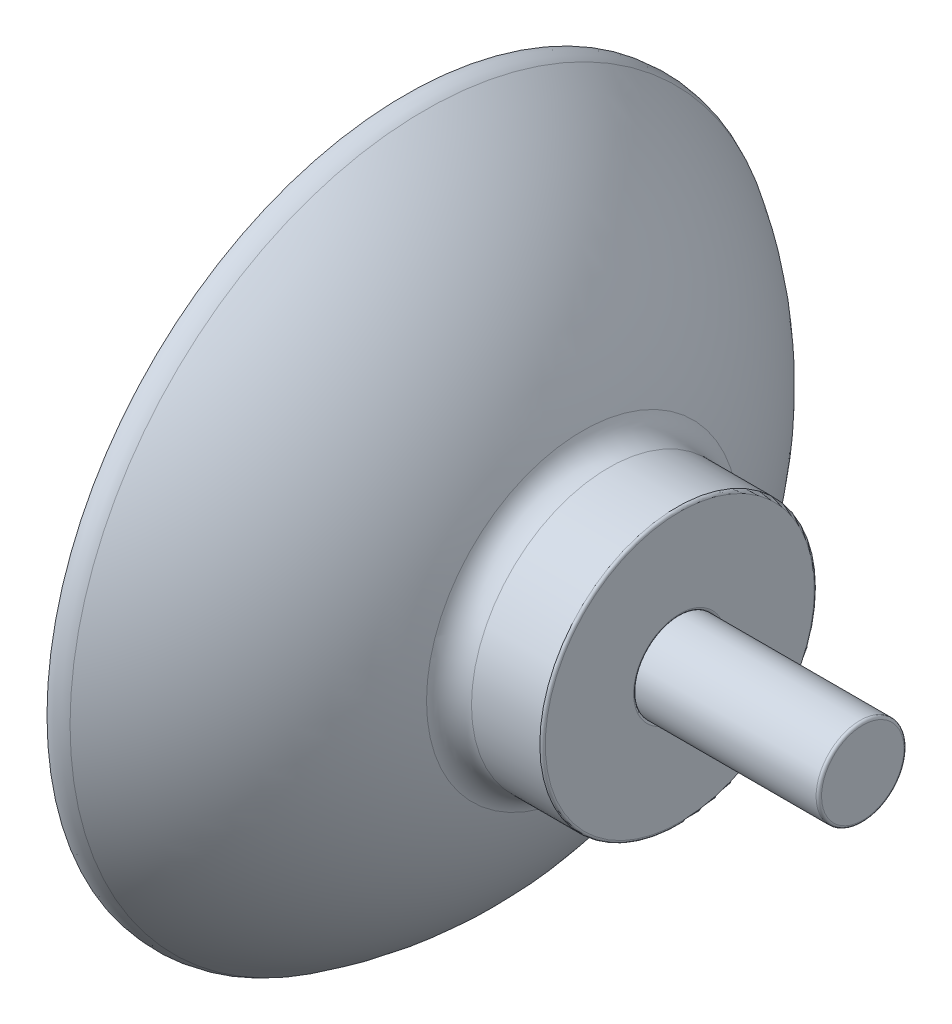
ISO-10303-21;
HEADER;
FILE_DESCRIPTION(('STEP AP214'),'2;1');
FILE_NAME('part.step','',(''),(''),'','','');
FILE_SCHEMA(('AUTOMOTIVE_DESIGN { 1 0 10303 214 1 1 1 1 }'));
ENDSEC;
DATA;
#1=APPLICATION_CONTEXT('core data for automotive mechanical design processes');
#2=APPLICATION_PROTOCOL_DEFINITION('international standard','automotive_design',2000,#1);
#3=PRODUCT_CONTEXT('',#1,'mechanical');
#4=PRODUCT('Part','Part','',(#3));
#5=PRODUCT_RELATED_PRODUCT_CATEGORY('part','',(#4));
#6=PRODUCT_DEFINITION_FORMATION('','',#4);
#7=PRODUCT_DEFINITION_CONTEXT('part definition',#1,'design');
#8=PRODUCT_DEFINITION('design','',#6,#7);
#9=PRODUCT_DEFINITION_SHAPE('','',#8);
#10=(LENGTH_UNIT() NAMED_UNIT(*) SI_UNIT(.MILLI.,.METRE.));
#11=(NAMED_UNIT(*) PLANE_ANGLE_UNIT() SI_UNIT($,.RADIAN.));
#12=(NAMED_UNIT(*) SI_UNIT($,.STERADIAN.) SOLID_ANGLE_UNIT());
#13=UNCERTAINTY_MEASURE_WITH_UNIT(LENGTH_MEASURE(1.E-05),#10,'distance_accuracy_value','');
#14=(GEOMETRIC_REPRESENTATION_CONTEXT(3) GLOBAL_UNCERTAINTY_ASSIGNED_CONTEXT((#13)) GLOBAL_UNIT_ASSIGNED_CONTEXT((#10,
#11,#12)) REPRESENTATION_CONTEXT('',''));
#15=CARTESIAN_POINT('',(0.,0.,0.));
#16=DIRECTION('',(0.,0.,1.));
#17=DIRECTION('',(1.,0.,0.));
#18=AXIS2_PLACEMENT_3D('',#15,#16,#17);
#19=CARTESIAN_POINT('',(2.,0.,0.));
#20=DIRECTION('',(-1.,0.,0.));
#21=DIRECTION('',(0.,-1.,0.));
#22=AXIS2_PLACEMENT_3D('',#19,#20,#21);
#23=PLANE('',#22);
#24=CARTESIAN_POINT('',(2.,0.,0.));
#25=DIRECTION('',(1.,0.,0.));
#26=DIRECTION('',(0.,1.,0.));
#27=AXIS2_PLACEMENT_3D('',#24,#25,#26);
#28=CIRCLE('',#27,4.75);
#29=CARTESIAN_POINT('',(2.,4.75,0.));
#30=VERTEX_POINT('',#29);
#31=EDGE_CURVE('E54',#30,#30,#28,.T.);
#32=ORIENTED_EDGE('',*,*,#31,.F.);
#33=EDGE_LOOP('',(#32));
#34=FACE_BOUND('',#33,.T.);
#35=ADVANCED_FACE('F43',(#34),#23,.T.);
#36=CARTESIAN_POINT('',(15.,0.,0.));
#37=DIRECTION('',(1.,0.,0.));
#38=DIRECTION('',(0.,1.,0.));
#39=AXIS2_PLACEMENT_3D('',#36,#37,#38);
#40=CYLINDRICAL_SURFACE('',#39,4.75);
#41=ORIENTED_EDGE('',*,*,#31,.T.);
#42=EDGE_LOOP('',(#41));
#43=FACE_BOUND('',#42,.T.);
#44=CARTESIAN_POINT('',(4.,0.,0.));
#45=DIRECTION('',(1.,0.,0.));
#46=DIRECTION('',(0.,1.,0.));
#47=AXIS2_PLACEMENT_3D('',#44,#45,#46);
#48=CIRCLE('',#47,4.75);
#49=CARTESIAN_POINT('',(4.,4.75,0.));
#50=VERTEX_POINT('',#49);
#51=EDGE_CURVE('E58',#50,#50,#48,.T.);
#52=ORIENTED_EDGE('',*,*,#51,.F.);
#53=EDGE_LOOP('',(#52));
#54=FACE_BOUND('',#53,.T.);
#55=ADVANCED_FACE('F71',(#43,#54),#40,.T.);
#56=CARTESIAN_POINT('',(4.,4.75,0.));
#57=DIRECTION('',(1.,0.,0.));
#58=DIRECTION('',(0.,1.,0.));
#59=AXIS2_PLACEMENT_3D('',#56,#57,#58);
#60=PLANE('',#59);
#61=ORIENTED_EDGE('',*,*,#51,.T.);
#62=EDGE_LOOP('',(#61));
#63=FACE_BOUND('',#62,.T.);
#64=CARTESIAN_POINT('',(4.,0.,0.));
#65=DIRECTION('',(1.,0.,0.));
#66=DIRECTION('',(0.,1.,0.));
#67=AXIS2_PLACEMENT_3D('',#64,#65,#66);
#68=CIRCLE('',#67,2.4);
#69=CARTESIAN_POINT('',(4.,2.4,0.));
#70=VERTEX_POINT('',#69);
#71=EDGE_CURVE('E63',#70,#70,#68,.T.);
#72=ORIENTED_EDGE('',*,*,#71,.F.);
#73=EDGE_LOOP('',(#72));
#74=FACE_BOUND('',#73,.T.);
#75=ADVANCED_FACE('F69',(#63,#74),#60,.T.);
#76=CARTESIAN_POINT('',(15.,0.,0.));
#77=DIRECTION('',(1.,0.,0.));
#78=DIRECTION('',(0.,1.,0.));
#79=AXIS2_PLACEMENT_3D('',#76,#77,#78);
#80=CYLINDRICAL_SURFACE('',#79,2.4);
#81=CARTESIAN_POINT('',(14.85,0.,0.));
#82=DIRECTION('',(1.,0.,0.));
#83=DIRECTION('',(0.,1.,0.));
#84=AXIS2_PLACEMENT_3D('',#81,#82,#83);
#85=CIRCLE('',#84,2.4);
#86=CARTESIAN_POINT('',(14.85,2.4,0.));
#87=VERTEX_POINT('',#86);
#88=EDGE_CURVE('E11',#87,#87,#85,.F.);
#89=ORIENTED_EDGE('',*,*,#88,.T.);
#90=EDGE_LOOP('',(#89));
#91=FACE_BOUND('',#90,.T.);
#92=ORIENTED_EDGE('',*,*,#71,.T.);
#93=EDGE_LOOP('',(#92));
#94=FACE_BOUND('',#93,.T.);
#95=ADVANCED_FACE('F67',(#91,#94),#80,.T.);
#96=CARTESIAN_POINT('',(15.,2.4,0.));
#97=DIRECTION('',(1.,0.,0.));
#98=DIRECTION('',(0.,1.,0.));
#99=AXIS2_PLACEMENT_3D('',#96,#97,#98);
#100=PLANE('',#99);
#101=CARTESIAN_POINT('',(15.,0.,0.));
#102=DIRECTION('',(1.,0.,0.));
#103=DIRECTION('',(0.,1.,0.));
#104=AXIS2_PLACEMENT_3D('',#101,#102,#103);
#105=CIRCLE('',#104,2.25);
#106=CARTESIAN_POINT('',(15.,2.25,0.));
#107=VERTEX_POINT('',#106);
#108=EDGE_CURVE('E50',#107,#107,#105,.T.);
#109=ORIENTED_EDGE('',*,*,#108,.T.);
#110=EDGE_LOOP('',(#109));
#111=FACE_BOUND('',#110,.T.);
#112=ADVANCED_FACE('F78',(#111),#100,.T.);
#113=CARTESIAN_POINT('',(14.85,0.,0.));
#114=DIRECTION('',(1.,0.,0.));
#115=DIRECTION('',(0.,1.,0.));
#116=AXIS2_PLACEMENT_3D('',#113,#114,#115);
#117=TOROIDAL_SURFACE('',#116,2.25,0.15);
#118=ORIENTED_EDGE('',*,*,#88,.F.);
#119=EDGE_LOOP('',(#118));
#120=FACE_BOUND('',#119,.T.);
#121=ORIENTED_EDGE('',*,*,#108,.F.);
#122=EDGE_LOOP('',(#121));
#123=FACE_BOUND('',#122,.T.);
#124=ADVANCED_FACE('F45',(#120,#123),#117,.T.);
#125=CLOSED_SHELL('',(#35,#55,#75,#95,#112,#124));
#126=MANIFOLD_SOLID_BREP('B2',#125);
#127=CARTESIAN_POINT('',(4.,0.,0.));
#128=DIRECTION('',(1.,0.,0.));
#129=DIRECTION('',(0.,0.,-1.));
#130=AXIS2_PLACEMENT_3D('',#127,#128,#129);
#131=PLANE('',#130);
#132=CARTESIAN_POINT('',(4.,0.,0.));
#133=DIRECTION('',(1.,0.,0.));
#134=DIRECTION('',(0.,0.,-1.));
#135=AXIS2_PLACEMENT_3D('',#132,#133,#134);
#136=CIRCLE('',#135,2.525);
#137=CARTESIAN_POINT('',(4.,0.,-2.525));
#138=VERTEX_POINT('',#137);
#139=EDGE_CURVE('E161',#138,#138,#136,.T.);
#140=ORIENTED_EDGE('',*,*,#139,.T.);
#141=EDGE_LOOP('',(#140));
#142=FACE_BOUND('',#141,.T.);
#143=CARTESIAN_POINT('',(4.,0.,0.));
#144=DIRECTION('',(1.,0.,0.));
#145=DIRECTION('',(0.,0.,-1.));
#146=AXIS2_PLACEMENT_3D('',#143,#144,#145);
#147=CIRCLE('',#146,4.75);
#148=CARTESIAN_POINT('',(4.,0.,-4.75));
#149=VERTEX_POINT('',#148);
#150=EDGE_CURVE('E179',#149,#149,#147,.T.);
#151=ORIENTED_EDGE('',*,*,#150,.F.);
#152=EDGE_LOOP('',(#151));
#153=FACE_BOUND('',#152,.T.);
#154=ADVANCED_FACE('F129',(#142,#153),#131,.F.);
#155=CARTESIAN_POINT('',(0.,0.,0.));
#156=DIRECTION('',(1.,0.,0.));
#157=DIRECTION('',(0.,0.,-1.));
#158=AXIS2_PLACEMENT_3D('',#155,#156,#157);
#159=CYLINDRICAL_SURFACE('',#158,2.375);
#160=CARTESIAN_POINT('',(4.15,0.,0.));
#161=DIRECTION('',(1.,0.,0.));
#162=DIRECTION('',(0.,0.,-1.));
#163=AXIS2_PLACEMENT_3D('',#160,#161,#162);
#164=CIRCLE('',#163,2.375);
#165=CARTESIAN_POINT('',(4.15,0.,-2.375));
#166=VERTEX_POINT('',#165);
#167=EDGE_CURVE('E155',#166,#166,#164,.F.);
#168=ORIENTED_EDGE('',*,*,#167,.T.);
#169=EDGE_LOOP('',(#168));
#170=FACE_BOUND('',#169,.T.);
#171=CARTESIAN_POINT('',(4.85,0.,0.));
#172=DIRECTION('',(1.,0.,0.));
#173=DIRECTION('',(0.,0.,-1.));
#174=AXIS2_PLACEMENT_3D('',#171,#172,#173);
#175=CIRCLE('',#174,2.375);
#176=CARTESIAN_POINT('',(4.85,0.,-2.375));
#177=VERTEX_POINT('',#176);
#178=EDGE_CURVE('E158',#177,#177,#175,.T.);
#179=ORIENTED_EDGE('',*,*,#178,.T.);
#180=EDGE_LOOP('',(#179));
#181=FACE_BOUND('',#180,.T.);
#182=ADVANCED_FACE('F187',(#170,#181),#159,.F.);
#183=CARTESIAN_POINT('',(5.,0.,0.));
#184=DIRECTION('',(1.,0.,0.));
#185=DIRECTION('',(0.,0.,-1.));
#186=AXIS2_PLACEMENT_3D('',#183,#184,#185);
#187=PLANE('',#186);
#188=CARTESIAN_POINT('',(5.,0.,0.));
#189=DIRECTION('',(1.,0.,0.));
#190=DIRECTION('',(0.,0.,-1.));
#191=AXIS2_PLACEMENT_3D('',#188,#189,#190);
#192=CIRCLE('',#191,2.525);
#193=CARTESIAN_POINT('',(5.,0.,-2.525));
#194=VERTEX_POINT('',#193);
#195=EDGE_CURVE('E149',#194,#194,#192,.F.);
#196=ORIENTED_EDGE('',*,*,#195,.T.);
#197=EDGE_LOOP('',(#196));
#198=FACE_BOUND('',#197,.T.);
#199=CARTESIAN_POINT('',(5.,0.,0.));
#200=DIRECTION('',(1.,0.,0.));
#201=DIRECTION('',(0.,0.,-1.));
#202=AXIS2_PLACEMENT_3D('',#199,#200,#201);
#203=CIRCLE('',#202,7.35);
#204=CARTESIAN_POINT('',(5.,0.,-7.35));
#205=VERTEX_POINT('',#204);
#206=EDGE_CURVE('E152',#205,#205,#203,.T.);
#207=ORIENTED_EDGE('',*,*,#206,.T.);
#208=EDGE_LOOP('',(#207));
#209=FACE_BOUND('',#208,.T.);
#210=ADVANCED_FACE('F193',(#198,#209),#187,.T.);
#211=CARTESIAN_POINT('',(0.,0.,0.));
#212=DIRECTION('',(1.,0.,0.));
#213=DIRECTION('',(0.,0.,-1.));
#214=AXIS2_PLACEMENT_3D('',#211,#212,#213);
#215=CYLINDRICAL_SURFACE('',#214,7.5);
#216=CARTESIAN_POINT('',(1.11723092580122,0.,0.));
#217=DIRECTION('',(1.,0.,0.));
#218=DIRECTION('',(0.,0.,-1.));
#219=AXIS2_PLACEMENT_3D('',#216,#217,#218);
#220=CIRCLE('',#219,7.5);
#221=CARTESIAN_POINT('',(1.11723092580122,0.,-7.5));
#222=VERTEX_POINT('',#221);
#223=EDGE_CURVE('E42',#222,#222,#220,.T.);
#224=ORIENTED_EDGE('',*,*,#223,.T.);
#225=EDGE_LOOP('',(#224));
#226=FACE_BOUND('',#225,.T.);
#227=CARTESIAN_POINT('',(4.85,0.,0.));
#228=DIRECTION('',(1.,0.,0.));
#229=DIRECTION('',(0.,0.,-1.));
#230=AXIS2_PLACEMENT_3D('',#227,#228,#229);
#231=CIRCLE('',#230,7.5);
#232=CARTESIAN_POINT('',(4.85,0.,-7.5));
#233=VERTEX_POINT('',#232);
#234=EDGE_CURVE('E144',#233,#233,#231,.F.);
#235=ORIENTED_EDGE('',*,*,#234,.T.);
#236=EDGE_LOOP('',(#235));
#237=FACE_BOUND('',#236,.T.);
#238=ADVANCED_FACE('F235',(#226,#237),#215,.T.);
#239=CARTESIAN_POINT('',(-19.3122304000596,0.,0.));
#240=DIRECTION('',(1.,0.,0.));
#241=DIRECTION('',(0.,0.,-1.));
#242=AXIS2_PLACEMENT_3D('',#239,#240,#241);
#243=DEGENERATE_TOROIDAL_SURFACE('',#242,2.30021567995232,20.,.T.);
#244=CARTESIAN_POINT('',(-8.92809859857814,0.,0.));
#245=DIRECTION('',(-1.,0.,0.));
#246=DIRECTION('',(0.,0.,1.));
#247=AXIS2_PLACEMENT_3D('',#244,#245,#246);
#248=CIRCLE('',#247,19.3931910420554);
#249=CARTESIAN_POINT('',(-8.92809859857814,0.,19.3931910420554));
#250=VERTEX_POINT('',#249);
#251=EDGE_CURVE('E136',#250,#250,#248,.F.);
#252=ORIENTED_EDGE('',*,*,#251,.T.);
#253=EDGE_LOOP('',(#252));
#254=FACE_BOUND('',#253,.T.);
#255=CARTESIAN_POINT('',(-0.308080329491398,0.,0.));
#256=DIRECTION('',(-1.,0.,0.));
#257=DIRECTION('',(0.,0.,1.));
#258=AXIS2_PLACEMENT_3D('',#255,#256,#257);
#259=CIRCLE('',#258,8.53257318697341);
#260=CARTESIAN_POINT('',(-0.308080329491397,0.,8.53257318697341));
#261=VERTEX_POINT('',#260);
#262=EDGE_CURVE('E140',#261,#261,#259,.T.);
#263=ORIENTED_EDGE('',*,*,#262,.T.);
#264=EDGE_LOOP('',(#263));
#265=FACE_BOUND('',#264,.T.);
#266=ADVANCED_FACE('F232',(#254,#265),#243,.T.);
#267=CARTESIAN_POINT('',(-21.7835977429209,0.,0.));
#268=DIRECTION('',(1.,0.,0.));
#269=DIRECTION('',(0.,0.,-1.));
#270=AXIS2_PLACEMENT_3D('',#267,#268,#269);
#271=DEGENERATE_TOROIDAL_SURFACE('',#270,0.921872423922007,22.,.T.);
#272=CARTESIAN_POINT('',(-9.93081443166763,0.,0.));
#273=DIRECTION('',(-1.,0.,0.));
#274=DIRECTION('',(0.,0.,1.));
#275=AXIS2_PLACEMENT_3D('',#272,#273,#274);
#276=CIRCLE('',#275,19.4559364082854);
#277=CARTESIAN_POINT('',(-9.93081443166763,0.,19.4559364082854));
#278=VERTEX_POINT('',#277);
#279=EDGE_CURVE('E167',#278,#278,#276,.T.);
#280=ORIENTED_EDGE('',*,*,#279,.T.);
#281=EDGE_LOOP('',(#280));
#282=FACE_BOUND('',#281,.T.);
#283=CARTESIAN_POINT('',(-0.0014855990188474,0.,0.));
#284=DIRECTION('',(-1.,0.,0.));
#285=DIRECTION('',(0.,0.,1.));
#286=AXIS2_PLACEMENT_3D('',#283,#284,#285);
#287=CIRCLE('',#286,4.01049518341775);
#288=CARTESIAN_POINT('',(-0.00148559901884691,0.,4.01049518341775));
#289=VERTEX_POINT('',#288);
#290=EDGE_CURVE('E170',#289,#289,#287,.F.);
#291=ORIENTED_EDGE('',*,*,#290,.T.);
#292=EDGE_LOOP('',(#291));
#293=FACE_BOUND('',#292,.T.);
#294=ADVANCED_FACE('F234',(#282,#293),#271,.F.);
#295=CARTESIAN_POINT('',(0.,0.,0.));
#296=DIRECTION('',(1.,0.,0.));
#297=DIRECTION('',(0.,0.,-1.));
#298=AXIS2_PLACEMENT_3D('',#295,#296,#297);
#299=PLANE('',#298);
#300=CARTESIAN_POINT('',(0.,0.,0.));
#301=DIRECTION('',(1.,0.,0.));
#302=DIRECTION('',(0.,0.,-1.));
#303=AXIS2_PLACEMENT_3D('',#300,#301,#302);
#304=CIRCLE('',#303,3.98943639187573);
#305=CARTESIAN_POINT('',(0.,0.,-3.98943639187573));
#306=VERTEX_POINT('',#305);
#307=EDGE_CURVE('E164',#306,#306,#304,.F.);
#308=ORIENTED_EDGE('',*,*,#307,.T.);
#309=EDGE_LOOP('',(#308));
#310=FACE_BOUND('',#309,.T.);
#311=ADVANCED_FACE('F241',(#310),#299,.F.);
#312=CARTESIAN_POINT('',(2.,0.,0.));
#313=DIRECTION('',(1.,0.,0.));
#314=DIRECTION('',(0.,0.,-1.));
#315=AXIS2_PLACEMENT_3D('',#312,#313,#314);
#316=PLANE('',#315);
#317=CARTESIAN_POINT('',(2.,0.,0.));
#318=DIRECTION('',(1.,0.,0.));
#319=DIRECTION('',(0.,0.,-1.));
#320=AXIS2_PLACEMENT_3D('',#317,#318,#319);
#321=CIRCLE('',#320,4.75);
#322=CARTESIAN_POINT('',(2.,0.,-4.75));
#323=VERTEX_POINT('',#322);
#324=EDGE_CURVE('E176',#323,#323,#321,.T.);
#325=ORIENTED_EDGE('',*,*,#324,.T.);
#326=EDGE_LOOP('',(#325));
#327=FACE_BOUND('',#326,.T.);
#328=ADVANCED_FACE('F313',(#327),#316,.T.);
#329=CARTESIAN_POINT('',(0.,0.,0.));
#330=DIRECTION('',(1.,0.,0.));
#331=DIRECTION('',(0.,0.,-1.));
#332=AXIS2_PLACEMENT_3D('',#329,#330,#331);
#333=CYLINDRICAL_SURFACE('',#332,4.75);
#334=ORIENTED_EDGE('',*,*,#150,.T.);
#335=EDGE_LOOP('',(#334));
#336=FACE_BOUND('',#335,.T.);
#337=ORIENTED_EDGE('',*,*,#324,.F.);
#338=EDGE_LOOP('',(#337));
#339=FACE_BOUND('',#338,.T.);
#340=ADVANCED_FACE('F183',(#336,#339),#333,.F.);
#341=CARTESIAN_POINT('',(-9.85,0.,0.));
#342=DIRECTION('',(-1.,0.,0.));
#343=DIRECTION('',(0.,0.,1.));
#344=AXIS2_PLACEMENT_3D('',#341,#342,#343);
#345=TOROIDAL_SURFACE('',#344,19.5823050263606,0.15);
#346=ORIENTED_EDGE('',*,*,#279,.F.);
#347=EDGE_LOOP('',(#346));
#348=FACE_BOUND('',#347,.T.);
#349=CARTESIAN_POINT('',(-10.,0.,0.));
#350=DIRECTION('',(-1.,0.,0.));
#351=DIRECTION('',(0.,0.,1.));
#352=AXIS2_PLACEMENT_3D('',#349,#350,#351);
#353=CIRCLE('',#352,19.5823050263606);
#354=CARTESIAN_POINT('',(-10.,0.,19.5823050263606));
#355=VERTEX_POINT('',#354);
#356=EDGE_CURVE('E173',#355,#355,#353,.F.);
#357=ORIENTED_EDGE('',*,*,#356,.F.);
#358=EDGE_LOOP('',(#357));
#359=FACE_BOUND('',#358,.T.);
#360=ADVANCED_FACE('F198',(#348,#359),#345,.T.);
#361=CARTESIAN_POINT('',(-0.150000000000001,0.,0.));
#362=DIRECTION('',(1.,0.,0.));
#363=DIRECTION('',(0.,0.,-1.));
#364=AXIS2_PLACEMENT_3D('',#361,#362,#363);
#365=TOROIDAL_SURFACE('',#364,3.98943639187573,0.15);
#366=ORIENTED_EDGE('',*,*,#307,.F.);
#367=EDGE_LOOP('',(#366));
#368=FACE_BOUND('',#367,.T.);
#369=ORIENTED_EDGE('',*,*,#290,.F.);
#370=EDGE_LOOP('',(#369));
#371=FACE_BOUND('',#370,.T.);
#372=ADVANCED_FACE('F201',(#368,#371),#365,.F.);
#373=CARTESIAN_POINT('',(4.15,0.,0.));
#374=DIRECTION('',(1.,0.,0.));
#375=DIRECTION('',(0.,0.,-1.));
#376=AXIS2_PLACEMENT_3D('',#373,#374,#375);
#377=TOROIDAL_SURFACE('',#376,2.525,0.15);
#378=ORIENTED_EDGE('',*,*,#167,.F.);
#379=EDGE_LOOP('',(#378));
#380=FACE_BOUND('',#379,.T.);
#381=ORIENTED_EDGE('',*,*,#139,.F.);
#382=EDGE_LOOP('',(#381));
#383=FACE_BOUND('',#382,.T.);
#384=ADVANCED_FACE('F205',(#380,#383),#377,.T.);
#385=CARTESIAN_POINT('',(4.85,0.,0.));
#386=DIRECTION('',(1.,0.,0.));
#387=DIRECTION('',(0.,0.,-1.));
#388=AXIS2_PLACEMENT_3D('',#385,#386,#387);
#389=TOROIDAL_SURFACE('',#388,2.525,0.15);
#390=ORIENTED_EDGE('',*,*,#195,.F.);
#391=EDGE_LOOP('',(#390));
#392=FACE_BOUND('',#391,.T.);
#393=ORIENTED_EDGE('',*,*,#178,.F.);
#394=EDGE_LOOP('',(#393));
#395=FACE_BOUND('',#394,.T.);
#396=ADVANCED_FACE('F209',(#392,#395),#389,.T.);
#397=CARTESIAN_POINT('',(4.85,0.,0.));
#398=DIRECTION('',(1.,0.,0.));
#399=DIRECTION('',(0.,0.,-1.));
#400=AXIS2_PLACEMENT_3D('',#397,#398,#399);
#401=TOROIDAL_SURFACE('',#400,7.35,0.15);
#402=ORIENTED_EDGE('',*,*,#234,.F.);
#403=EDGE_LOOP('',(#402));
#404=FACE_BOUND('',#403,.T.);
#405=ORIENTED_EDGE('',*,*,#206,.F.);
#406=EDGE_LOOP('',(#405));
#407=FACE_BOUND('',#406,.T.);
#408=ADVANCED_FACE('F213',(#404,#407),#401,.T.);
#409=CARTESIAN_POINT('',(-9.70690848368925,0.,0.));
#410=DIRECTION('',(-1.,0.,0.));
#411=DIRECTION('',(0.,0.,1.));
#412=AXIS2_PLACEMENT_3D('',#409,#410,#411);
#413=TOROIDAL_SURFACE('',#412,18.1112178898976,1.5);
#414=ORIENTED_EDGE('',*,*,#356,.T.);
#415=EDGE_LOOP('',(#414));
#416=FACE_BOUND('',#415,.T.);
#417=ORIENTED_EDGE('',*,*,#251,.F.);
#418=EDGE_LOOP('',(#417));
#419=FACE_BOUND('',#418,.T.);
#420=ADVANCED_FACE('F216',(#416,#419),#413,.T.);
#421=CARTESIAN_POINT('',(1.11723092580122,0.,0.));
#422=DIRECTION('',(1.,0.,0.));
#423=DIRECTION('',(0.,0.,-1.));
#424=AXIS2_PLACEMENT_3D('',#421,#422,#423);
#425=TOROIDAL_SURFACE('',#424,9.,1.5);
#426=ORIENTED_EDGE('',*,*,#262,.F.);
#427=EDGE_LOOP('',(#426));
#428=FACE_BOUND('',#427,.T.);
#429=ORIENTED_EDGE('',*,*,#223,.F.);
#430=EDGE_LOOP('',(#429));
#431=FACE_BOUND('',#430,.T.);
#432=ADVANCED_FACE('F131',(#428,#431),#425,.F.);
#433=CLOSED_SHELL('',(#154,#182,#210,#238,#266,#294,#311,#328,#340,#360,#372,#384,#396,#408,
#420,#432));
#434=MANIFOLD_SOLID_BREP('B6',#433);
#435=ADVANCED_BREP_SHAPE_REPRESENTATION('',(#18,#126,#434),#14);
#436=SHAPE_DEFINITION_REPRESENTATION(#9,#435);
ENDSEC;
END-ISO-10303-21;
